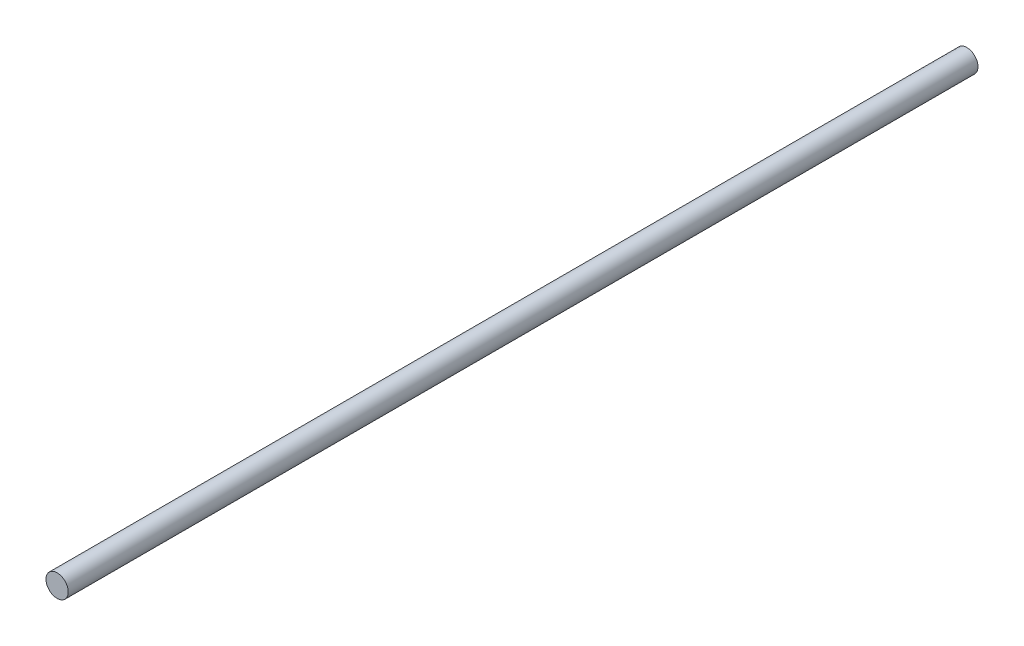
ISO-10303-21;
HEADER;
FILE_DESCRIPTION(('STEP AP214'),'2;1');
FILE_NAME('part.step','',(''),(''),'','','');
FILE_SCHEMA(('AUTOMOTIVE_DESIGN { 1 0 10303 214 1 1 1 1 }'));
ENDSEC;
DATA;
#1=APPLICATION_CONTEXT('core data for automotive mechanical design processes');
#2=APPLICATION_PROTOCOL_DEFINITION('international standard','automotive_design',2000,#1);
#3=PRODUCT_CONTEXT('',#1,'mechanical');
#4=PRODUCT('Part','Part','',(#3));
#5=PRODUCT_RELATED_PRODUCT_CATEGORY('part','',(#4));
#6=PRODUCT_DEFINITION_FORMATION('','',#4);
#7=PRODUCT_DEFINITION_CONTEXT('part definition',#1,'design');
#8=PRODUCT_DEFINITION('design','',#6,#7);
#9=PRODUCT_DEFINITION_SHAPE('','',#8);
#10=(LENGTH_UNIT() NAMED_UNIT(*) SI_UNIT(.MILLI.,.METRE.));
#11=(NAMED_UNIT(*) PLANE_ANGLE_UNIT() SI_UNIT($,.RADIAN.));
#12=(NAMED_UNIT(*) SI_UNIT($,.STERADIAN.) SOLID_ANGLE_UNIT());
#13=UNCERTAINTY_MEASURE_WITH_UNIT(LENGTH_MEASURE(1.E-05),#10,'distance_accuracy_value','');
#14=(GEOMETRIC_REPRESENTATION_CONTEXT(3) GLOBAL_UNCERTAINTY_ASSIGNED_CONTEXT((#13)) GLOBAL_UNIT_ASSIGNED_CONTEXT((#10,
#11,#12)) REPRESENTATION_CONTEXT('',''));
#15=CARTESIAN_POINT('',(0.,0.,0.));
#16=DIRECTION('',(0.,0.,1.));
#17=DIRECTION('',(1.,0.,0.));
#18=AXIS2_PLACEMENT_3D('',#15,#16,#17);
#19=CARTESIAN_POINT('',(0.,0.,163.5));
#20=DIRECTION('',(0.,0.,-1.));
#21=DIRECTION('',(-1.,0.,0.));
#22=AXIS2_PLACEMENT_3D('',#19,#20,#21);
#23=CYLINDRICAL_SURFACE('',#22,4.);
#24=CARTESIAN_POINT('',(0.,0.,163.5));
#25=DIRECTION('',(0.,0.,1.));
#26=DIRECTION('',(1.,0.,0.));
#27=AXIS2_PLACEMENT_3D('',#24,#25,#26);
#28=CIRCLE('',#27,4.);
#29=CARTESIAN_POINT('',(4.,0.,163.5));
#30=VERTEX_POINT('',#29);
#31=EDGE_CURVE('E10',#30,#30,#28,.T.);
#32=ORIENTED_EDGE('',*,*,#31,.F.);
#33=EDGE_LOOP('',(#32));
#34=FACE_BOUND('',#33,.T.);
#35=CARTESIAN_POINT('',(0.,0.,-163.5));
#36=DIRECTION('',(0.,0.,1.));
#37=DIRECTION('',(1.,0.,0.));
#38=AXIS2_PLACEMENT_3D('',#35,#36,#37);
#39=CIRCLE('',#38,4.);
#40=CARTESIAN_POINT('',(4.,0.,-163.5));
#41=VERTEX_POINT('',#40);
#42=EDGE_CURVE('E35',#41,#41,#39,.T.);
#43=ORIENTED_EDGE('',*,*,#42,.T.);
#44=EDGE_LOOP('',(#43));
#45=FACE_BOUND('',#44,.T.);
#46=ADVANCED_FACE('F32',(#34,#45),#23,.T.);
#47=CARTESIAN_POINT('',(0.,0.,163.5));
#48=DIRECTION('',(0.,0.,1.));
#49=DIRECTION('',(1.,0.,0.));
#50=AXIS2_PLACEMENT_3D('',#47,#48,#49);
#51=PLANE('',#50);
#52=ORIENTED_EDGE('',*,*,#31,.T.);
#53=EDGE_LOOP('',(#52));
#54=FACE_BOUND('',#53,.T.);
#55=ADVANCED_FACE('F47',(#54),#51,.T.);
#56=CARTESIAN_POINT('',(0.,0.,-163.5));
#57=DIRECTION('',(0.,0.,1.));
#58=DIRECTION('',(1.,0.,0.));
#59=AXIS2_PLACEMENT_3D('',#56,#57,#58);
#60=PLANE('',#59);
#61=ORIENTED_EDGE('',*,*,#42,.F.);
#62=EDGE_LOOP('',(#61));
#63=FACE_BOUND('',#62,.T.);
#64=ADVANCED_FACE('F45',(#63),#60,.F.);
#65=CLOSED_SHELL('',(#46,#55,#64));
#66=MANIFOLD_SOLID_BREP('B2',#65);
#67=ADVANCED_BREP_SHAPE_REPRESENTATION('',(#18,#66),#14);
#68=SHAPE_DEFINITION_REPRESENTATION(#9,#67);
ENDSEC;
END-ISO-10303-21;
